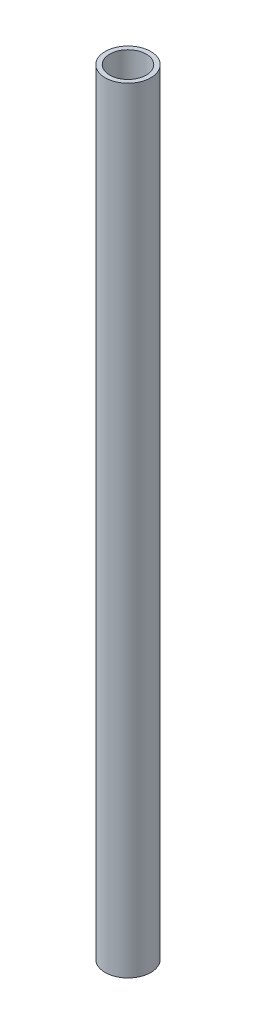
ISO-10303-21;
HEADER;
FILE_DESCRIPTION(('STEP AP214'),'2;1');
FILE_NAME('part.step','',(''),(''),'','','');
FILE_SCHEMA(('AUTOMOTIVE_DESIGN { 1 0 10303 214 1 1 1 1 }'));
ENDSEC;
DATA;
#1=APPLICATION_CONTEXT('core data for automotive mechanical design processes');
#2=APPLICATION_PROTOCOL_DEFINITION('international standard','automotive_design',2000,#1);
#3=PRODUCT_CONTEXT('',#1,'mechanical');
#4=PRODUCT('Part','Part','',(#3));
#5=PRODUCT_RELATED_PRODUCT_CATEGORY('part','',(#4));
#6=PRODUCT_DEFINITION_FORMATION('','',#4);
#7=PRODUCT_DEFINITION_CONTEXT('part definition',#1,'design');
#8=PRODUCT_DEFINITION('design','',#6,#7);
#9=PRODUCT_DEFINITION_SHAPE('','',#8);
#10=(LENGTH_UNIT() NAMED_UNIT(*) SI_UNIT(.MILLI.,.METRE.));
#11=(NAMED_UNIT(*) PLANE_ANGLE_UNIT() SI_UNIT($,.RADIAN.));
#12=(NAMED_UNIT(*) SI_UNIT($,.STERADIAN.) SOLID_ANGLE_UNIT());
#13=UNCERTAINTY_MEASURE_WITH_UNIT(LENGTH_MEASURE(1.E-05),#10,'distance_accuracy_value','');
#14=(GEOMETRIC_REPRESENTATION_CONTEXT(3) GLOBAL_UNCERTAINTY_ASSIGNED_CONTEXT((#13)) GLOBAL_UNIT_ASSIGNED_CONTEXT((#10,
#11,#12)) REPRESENTATION_CONTEXT('',''));
#15=CARTESIAN_POINT('',(0.,0.,0.));
#16=DIRECTION('',(0.,0.,1.));
#17=DIRECTION('',(1.,0.,0.));
#18=AXIS2_PLACEMENT_3D('',#15,#16,#17);
#19=CARTESIAN_POINT('',(0.,170.,0.));
#20=DIRECTION('',(0.,1.,0.));
#21=DIRECTION('',(0.,0.,1.));
#22=AXIS2_PLACEMENT_3D('',#19,#20,#21);
#23=PLANE('',#22);
#24=CARTESIAN_POINT('',(0.,170.,0.));
#25=DIRECTION('',(0.,1.,0.));
#26=DIRECTION('',(0.,0.,1.));
#27=AXIS2_PLACEMENT_3D('',#24,#25,#26);
#28=CIRCLE('',#27,5.);
#29=CARTESIAN_POINT('',(0.,170.,5.));
#30=VERTEX_POINT('',#29);
#31=EDGE_CURVE('E10',#30,#30,#28,.T.);
#32=ORIENTED_EDGE('',*,*,#31,.T.);
#33=EDGE_LOOP('',(#32));
#34=FACE_BOUND('',#33,.T.);
#35=CARTESIAN_POINT('',(0.,170.,0.));
#36=DIRECTION('',(0.,1.,0.));
#37=DIRECTION('',(0.,0.,1.));
#38=AXIS2_PLACEMENT_3D('',#35,#36,#37);
#39=CIRCLE('',#38,4.);
#40=CARTESIAN_POINT('',(0.,170.,4.));
#41=VERTEX_POINT('',#40);
#42=EDGE_CURVE('E42',#41,#41,#39,.T.);
#43=ORIENTED_EDGE('',*,*,#42,.F.);
#44=EDGE_LOOP('',(#43));
#45=FACE_BOUND('',#44,.T.);
#46=ADVANCED_FACE('F31',(#34,#45),#23,.T.);
#47=CARTESIAN_POINT('',(0.,0.,0.));
#48=DIRECTION('',(0.,1.,0.));
#49=DIRECTION('',(0.,0.,1.));
#50=AXIS2_PLACEMENT_3D('',#47,#48,#49);
#51=PLANE('',#50);
#52=CARTESIAN_POINT('',(0.,0.,0.));
#53=DIRECTION('',(0.,1.,0.));
#54=DIRECTION('',(0.,0.,1.));
#55=AXIS2_PLACEMENT_3D('',#52,#53,#54);
#56=CIRCLE('',#55,5.);
#57=CARTESIAN_POINT('',(0.,0.,5.));
#58=VERTEX_POINT('',#57);
#59=EDGE_CURVE('E35',#58,#58,#56,.T.);
#60=ORIENTED_EDGE('',*,*,#59,.F.);
#61=EDGE_LOOP('',(#60));
#62=FACE_BOUND('',#61,.T.);
#63=CARTESIAN_POINT('',(0.,0.,0.));
#64=DIRECTION('',(0.,1.,0.));
#65=DIRECTION('',(0.,0.,1.));
#66=AXIS2_PLACEMENT_3D('',#63,#64,#65);
#67=CIRCLE('',#66,4.);
#68=CARTESIAN_POINT('',(0.,0.,4.));
#69=VERTEX_POINT('',#68);
#70=EDGE_CURVE('E44',#69,#69,#67,.T.);
#71=ORIENTED_EDGE('',*,*,#70,.T.);
#72=EDGE_LOOP('',(#71));
#73=FACE_BOUND('',#72,.T.);
#74=ADVANCED_FACE('F54',(#62,#73),#51,.F.);
#75=CARTESIAN_POINT('',(0.,170.,0.));
#76=DIRECTION('',(0.,-1.,0.));
#77=DIRECTION('',(0.,0.,-1.));
#78=AXIS2_PLACEMENT_3D('',#75,#76,#77);
#79=CYLINDRICAL_SURFACE('',#78,5.);
#80=ORIENTED_EDGE('',*,*,#31,.F.);
#81=EDGE_LOOP('',(#80));
#82=FACE_BOUND('',#81,.T.);
#83=ORIENTED_EDGE('',*,*,#59,.T.);
#84=EDGE_LOOP('',(#83));
#85=FACE_BOUND('',#84,.T.);
#86=ADVANCED_FACE('F33',(#82,#85),#79,.T.);
#87=CARTESIAN_POINT('',(0.,170.,0.));
#88=DIRECTION('',(0.,-1.,0.));
#89=DIRECTION('',(0.,0.,-1.));
#90=AXIS2_PLACEMENT_3D('',#87,#88,#89);
#91=CYLINDRICAL_SURFACE('',#90,4.);
#92=ORIENTED_EDGE('',*,*,#42,.T.);
#93=EDGE_LOOP('',(#92));
#94=FACE_BOUND('',#93,.T.);
#95=ORIENTED_EDGE('',*,*,#70,.F.);
#96=EDGE_LOOP('',(#95));
#97=FACE_BOUND('',#96,.T.);
#98=ADVANCED_FACE('F50',(#94,#97),#91,.F.);
#99=CLOSED_SHELL('',(#46,#74,#86,#98));
#100=MANIFOLD_SOLID_BREP('B2',#99);
#101=ADVANCED_BREP_SHAPE_REPRESENTATION('',(#18,#100),#14);
#102=SHAPE_DEFINITION_REPRESENTATION(#9,#101);
ENDSEC;
END-ISO-10303-21;
